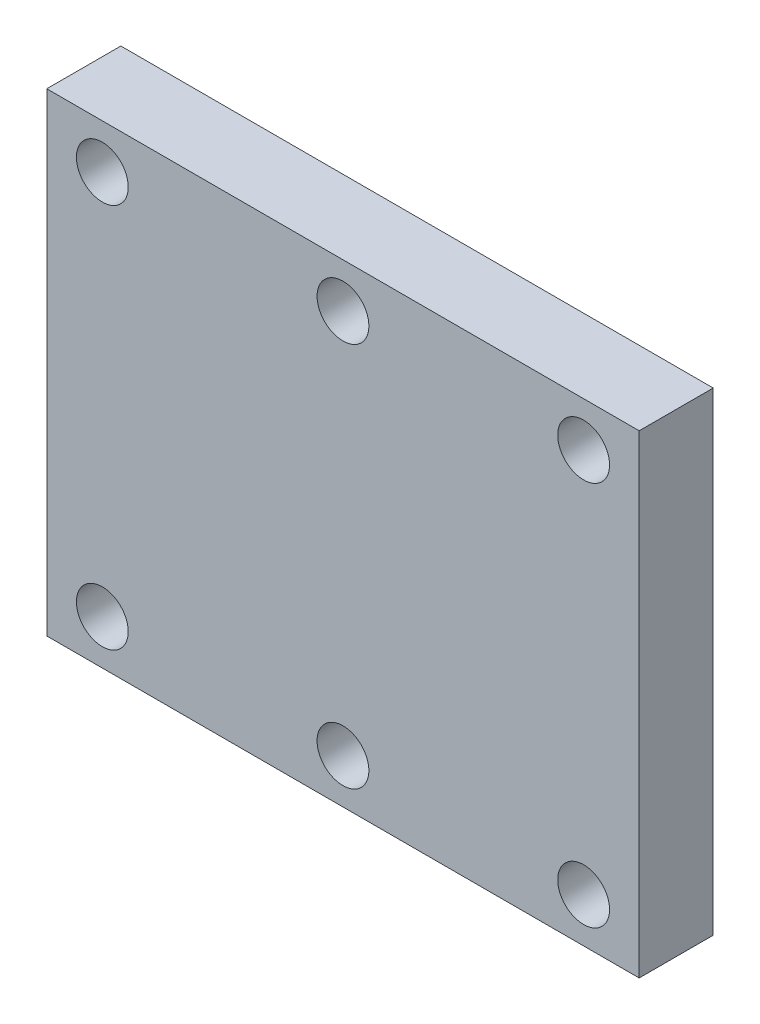
ISO-10303-21;
HEADER;
FILE_DESCRIPTION(('STEP AP214'),'2;1');
FILE_NAME('part.step','',(''),(''),'','','');
FILE_SCHEMA(('AUTOMOTIVE_DESIGN { 1 0 10303 214 1 1 1 1 }'));
ENDSEC;
DATA;
#1=APPLICATION_CONTEXT('core data for automotive mechanical design processes');
#2=APPLICATION_PROTOCOL_DEFINITION('international standard','automotive_design',2000,#1);
#3=PRODUCT_CONTEXT('',#1,'mechanical');
#4=PRODUCT('Part','Part','',(#3));
#5=PRODUCT_RELATED_PRODUCT_CATEGORY('part','',(#4));
#6=PRODUCT_DEFINITION_FORMATION('','',#4);
#7=PRODUCT_DEFINITION_CONTEXT('part definition',#1,'design');
#8=PRODUCT_DEFINITION('design','',#6,#7);
#9=PRODUCT_DEFINITION_SHAPE('','',#8);
#10=(LENGTH_UNIT() NAMED_UNIT(*) SI_UNIT(.MILLI.,.METRE.));
#11=(NAMED_UNIT(*) PLANE_ANGLE_UNIT() SI_UNIT($,.RADIAN.));
#12=(NAMED_UNIT(*) SI_UNIT($,.STERADIAN.) SOLID_ANGLE_UNIT());
#13=UNCERTAINTY_MEASURE_WITH_UNIT(LENGTH_MEASURE(1.E-05),#10,'distance_accuracy_value','');
#14=(GEOMETRIC_REPRESENTATION_CONTEXT(3) GLOBAL_UNCERTAINTY_ASSIGNED_CONTEXT((#13)) GLOBAL_UNIT_ASSIGNED_CONTEXT((#10,
#11,#12)) REPRESENTATION_CONTEXT('',''));
#15=CARTESIAN_POINT('',(0.,0.,0.));
#16=DIRECTION('',(0.,0.,1.));
#17=DIRECTION('',(1.,0.,0.));
#18=AXIS2_PLACEMENT_3D('',#15,#16,#17);
#19=CARTESIAN_POINT('',(72.5,26.,10.));
#20=DIRECTION('',(0.,0.,1.));
#21=DIRECTION('',(1.,0.,0.));
#22=AXIS2_PLACEMENT_3D('',#19,#20,#21);
#23=CYLINDRICAL_SURFACE('',#22,3.5);
#24=CARTESIAN_POINT('',(72.5,26.,10.));
#25=DIRECTION('',(0.,0.,1.));
#26=DIRECTION('',(1.,0.,0.));
#27=AXIS2_PLACEMENT_3D('',#24,#25,#26);
#28=CIRCLE('',#27,3.5);
#29=CARTESIAN_POINT('',(76.,26.,10.));
#30=VERTEX_POINT('',#29);
#31=EDGE_CURVE('E40',#30,#30,#28,.T.);
#32=ORIENTED_EDGE('',*,*,#31,.T.);
#33=EDGE_LOOP('',(#32));
#34=FACE_BOUND('',#33,.T.);
#35=CARTESIAN_POINT('',(72.5,26.,0.));
#36=DIRECTION('',(0.,0.,1.));
#37=DIRECTION('',(1.,0.,0.));
#38=AXIS2_PLACEMENT_3D('',#35,#36,#37);
#39=CIRCLE('',#38,3.5);
#40=CARTESIAN_POINT('',(76.,26.,0.));
#41=VERTEX_POINT('',#40);
#42=EDGE_CURVE('E11',#41,#41,#39,.T.);
#43=ORIENTED_EDGE('',*,*,#42,.F.);
#44=EDGE_LOOP('',(#43));
#45=FACE_BOUND('',#44,.T.);
#46=ADVANCED_FACE('F32',(#34,#45),#23,.F.);
#47=CARTESIAN_POINT('',(40.,26.,10.));
#48=DIRECTION('',(0.,0.,1.));
#49=DIRECTION('',(1.,0.,0.));
#50=AXIS2_PLACEMENT_3D('',#47,#48,#49);
#51=CYLINDRICAL_SURFACE('',#50,3.5);
#52=CARTESIAN_POINT('',(40.,26.,10.));
#53=DIRECTION('',(0.,0.,1.));
#54=DIRECTION('',(1.,0.,0.));
#55=AXIS2_PLACEMENT_3D('',#52,#53,#54);
#56=CIRCLE('',#55,3.5);
#57=CARTESIAN_POINT('',(43.5,26.,10.));
#58=VERTEX_POINT('',#57);
#59=EDGE_CURVE('E122',#58,#58,#56,.T.);
#60=ORIENTED_EDGE('',*,*,#59,.T.);
#61=EDGE_LOOP('',(#60));
#62=FACE_BOUND('',#61,.T.);
#63=CARTESIAN_POINT('',(40.,26.,0.));
#64=DIRECTION('',(0.,0.,1.));
#65=DIRECTION('',(1.,0.,0.));
#66=AXIS2_PLACEMENT_3D('',#63,#64,#65);
#67=CIRCLE('',#66,3.5);
#68=CARTESIAN_POINT('',(43.5,26.,0.));
#69=VERTEX_POINT('',#68);
#70=EDGE_CURVE('E125',#69,#69,#67,.T.);
#71=ORIENTED_EDGE('',*,*,#70,.F.);
#72=EDGE_LOOP('',(#71));
#73=FACE_BOUND('',#72,.T.);
#74=ADVANCED_FACE('F149',(#62,#73),#51,.F.);
#75=CARTESIAN_POINT('',(7.50000000000001,26.,10.));
#76=DIRECTION('',(0.,0.,1.));
#77=DIRECTION('',(1.,0.,0.));
#78=AXIS2_PLACEMENT_3D('',#75,#76,#77);
#79=CYLINDRICAL_SURFACE('',#78,3.5);
#80=CARTESIAN_POINT('',(7.50000000000001,26.,10.));
#81=DIRECTION('',(0.,0.,1.));
#82=DIRECTION('',(1.,0.,0.));
#83=AXIS2_PLACEMENT_3D('',#80,#81,#82);
#84=CIRCLE('',#83,3.5);
#85=CARTESIAN_POINT('',(11.,26.,10.));
#86=VERTEX_POINT('',#85);
#87=EDGE_CURVE('E116',#86,#86,#84,.T.);
#88=ORIENTED_EDGE('',*,*,#87,.T.);
#89=EDGE_LOOP('',(#88));
#90=FACE_BOUND('',#89,.T.);
#91=CARTESIAN_POINT('',(7.50000000000001,26.,0.));
#92=DIRECTION('',(0.,0.,1.));
#93=DIRECTION('',(1.,0.,0.));
#94=AXIS2_PLACEMENT_3D('',#91,#92,#93);
#95=CIRCLE('',#94,3.5);
#96=CARTESIAN_POINT('',(11.,26.,0.));
#97=VERTEX_POINT('',#96);
#98=EDGE_CURVE('E119',#97,#97,#95,.T.);
#99=ORIENTED_EDGE('',*,*,#98,.F.);
#100=EDGE_LOOP('',(#99));
#101=FACE_BOUND('',#100,.T.);
#102=ADVANCED_FACE('F153',(#90,#101),#79,.F.);
#103=CARTESIAN_POINT('',(72.5,-26.,10.));
#104=DIRECTION('',(0.,0.,1.));
#105=DIRECTION('',(1.,0.,0.));
#106=AXIS2_PLACEMENT_3D('',#103,#104,#105);
#107=CYLINDRICAL_SURFACE('',#106,3.5);
#108=CARTESIAN_POINT('',(72.5,-26.,10.));
#109=DIRECTION('',(0.,0.,1.));
#110=DIRECTION('',(1.,0.,0.));
#111=AXIS2_PLACEMENT_3D('',#108,#109,#110);
#112=CIRCLE('',#111,3.5);
#113=CARTESIAN_POINT('',(76.,-26.,10.));
#114=VERTEX_POINT('',#113);
#115=EDGE_CURVE('E110',#114,#114,#112,.T.);
#116=ORIENTED_EDGE('',*,*,#115,.T.);
#117=EDGE_LOOP('',(#116));
#118=FACE_BOUND('',#117,.T.);
#119=CARTESIAN_POINT('',(72.5,-26.,0.));
#120=DIRECTION('',(0.,0.,1.));
#121=DIRECTION('',(1.,0.,0.));
#122=AXIS2_PLACEMENT_3D('',#119,#120,#121);
#123=CIRCLE('',#122,3.5);
#124=CARTESIAN_POINT('',(76.,-26.,0.));
#125=VERTEX_POINT('',#124);
#126=EDGE_CURVE('E113',#125,#125,#123,.T.);
#127=ORIENTED_EDGE('',*,*,#126,.F.);
#128=EDGE_LOOP('',(#127));
#129=FACE_BOUND('',#128,.T.);
#130=ADVANCED_FACE('F158',(#118,#129),#107,.F.);
#131=CARTESIAN_POINT('',(0.,32.,10.));
#132=DIRECTION('',(1.,0.,0.));
#133=DIRECTION('',(0.,0.,-1.));
#134=AXIS2_PLACEMENT_3D('',#131,#132,#133);
#135=PLANE('',#134);
#136=DIRECTION('',(0.,-1.,0.));
#137=VECTOR('',#136,1.);
#138=CARTESIAN_POINT('',(0.,32.,0.));
#139=LINE('',#138,#137);
#140=CARTESIAN_POINT('',(0.,32.,0.));
#141=VERTEX_POINT('',#140);
#142=CARTESIAN_POINT('',(0.,-32.,0.));
#143=VERTEX_POINT('',#142);
#144=EDGE_CURVE('E100',#141,#143,#139,.T.);
#145=ORIENTED_EDGE('',*,*,#144,.T.);
#146=DIRECTION('',(0.,0.,-1.));
#147=VECTOR('',#146,1.);
#148=CARTESIAN_POINT('',(0.,-32.,10.));
#149=LINE('',#148,#147);
#150=CARTESIAN_POINT('',(0.,-32.,10.));
#151=VERTEX_POINT('',#150);
#152=EDGE_CURVE('E91',#151,#143,#149,.T.);
#153=ORIENTED_EDGE('',*,*,#152,.F.);
#154=DIRECTION('',(0.,-1.,0.));
#155=VECTOR('',#154,1.);
#156=CARTESIAN_POINT('',(0.,32.,10.));
#157=LINE('',#156,#155);
#158=CARTESIAN_POINT('',(0.,32.,10.));
#159=VERTEX_POINT('',#158);
#160=EDGE_CURVE('E85',#159,#151,#157,.T.);
#161=ORIENTED_EDGE('',*,*,#160,.F.);
#162=DIRECTION('',(0.,0.,-1.));
#163=VECTOR('',#162,1.);
#164=CARTESIAN_POINT('',(0.,32.,10.));
#165=LINE('',#164,#163);
#166=EDGE_CURVE('E96',#159,#141,#165,.T.);
#167=ORIENTED_EDGE('',*,*,#166,.T.);
#168=EDGE_LOOP('',(#145,#153,#161,#167));
#169=FACE_BOUND('',#168,.T.);
#170=ADVANCED_FACE('F165',(#169),#135,.F.);
#171=CARTESIAN_POINT('',(0.,-32.,10.));
#172=DIRECTION('',(0.,1.,0.));
#173=DIRECTION('',(0.,0.,1.));
#174=AXIS2_PLACEMENT_3D('',#171,#172,#173);
#175=PLANE('',#174);
#176=DIRECTION('',(1.,0.,0.));
#177=VECTOR('',#176,1.);
#178=CARTESIAN_POINT('',(0.,-32.,0.));
#179=LINE('',#178,#177);
#180=CARTESIAN_POINT('',(80.,-32.,0.));
#181=VERTEX_POINT('',#180);
#182=EDGE_CURVE('E90',#143,#181,#179,.T.);
#183=ORIENTED_EDGE('',*,*,#182,.T.);
#184=DIRECTION('',(0.,0.,-1.));
#185=VECTOR('',#184,1.);
#186=CARTESIAN_POINT('',(80.,-32.,10.));
#187=LINE('',#186,#185);
#188=CARTESIAN_POINT('',(80.,-32.,10.));
#189=VERTEX_POINT('',#188);
#190=EDGE_CURVE('E88',#189,#181,#187,.T.);
#191=ORIENTED_EDGE('',*,*,#190,.F.);
#192=DIRECTION('',(1.,0.,0.));
#193=VECTOR('',#192,1.);
#194=CARTESIAN_POINT('',(0.,-32.,10.));
#195=LINE('',#194,#193);
#196=EDGE_CURVE('E79',#151,#189,#195,.T.);
#197=ORIENTED_EDGE('',*,*,#196,.F.);
#198=ORIENTED_EDGE('',*,*,#152,.T.);
#199=EDGE_LOOP('',(#183,#191,#197,#198));
#200=FACE_BOUND('',#199,.T.);
#201=ADVANCED_FACE('F89',(#200),#175,.F.);
#202=CARTESIAN_POINT('',(80.,32.,10.));
#203=DIRECTION('',(-1.,0.,0.));
#204=DIRECTION('',(0.,0.,1.));
#205=AXIS2_PLACEMENT_3D('',#202,#203,#204);
#206=PLANE('',#205);
#207=DIRECTION('',(0.,1.,0.));
#208=VECTOR('',#207,1.);
#209=CARTESIAN_POINT('',(80.,32.,0.));
#210=LINE('',#209,#208);
#211=CARTESIAN_POINT('',(80.,32.,0.));
#212=VERTEX_POINT('',#211);
#213=EDGE_CURVE('E65',#181,#212,#210,.T.);
#214=ORIENTED_EDGE('',*,*,#213,.T.);
#215=DIRECTION('',(0.,0.,-1.));
#216=VECTOR('',#215,1.);
#217=CARTESIAN_POINT('',(80.,32.,10.));
#218=LINE('',#217,#216);
#219=CARTESIAN_POINT('',(80.,32.,10.));
#220=VERTEX_POINT('',#219);
#221=EDGE_CURVE('E92',#220,#212,#218,.T.);
#222=ORIENTED_EDGE('',*,*,#221,.F.);
#223=DIRECTION('',(0.,1.,0.));
#224=VECTOR('',#223,1.);
#225=CARTESIAN_POINT('',(80.,32.,10.));
#226=LINE('',#225,#224);
#227=EDGE_CURVE('E83',#189,#220,#226,.T.);
#228=ORIENTED_EDGE('',*,*,#227,.F.);
#229=ORIENTED_EDGE('',*,*,#190,.T.);
#230=EDGE_LOOP('',(#214,#222,#228,#229));
#231=FACE_BOUND('',#230,.T.);
#232=ADVANCED_FACE('F94',(#231),#206,.F.);
#233=CARTESIAN_POINT('',(0.,32.,10.));
#234=DIRECTION('',(0.,-1.,0.));
#235=DIRECTION('',(0.,0.,-1.));
#236=AXIS2_PLACEMENT_3D('',#233,#234,#235);
#237=PLANE('',#236);
#238=DIRECTION('',(-1.,0.,0.));
#239=VECTOR('',#238,1.);
#240=CARTESIAN_POINT('',(0.,32.,0.));
#241=LINE('',#240,#239);
#242=EDGE_CURVE('E71',#212,#141,#241,.T.);
#243=ORIENTED_EDGE('',*,*,#242,.T.);
#244=ORIENTED_EDGE('',*,*,#166,.F.);
#245=DIRECTION('',(-1.,0.,0.));
#246=VECTOR('',#245,1.);
#247=CARTESIAN_POINT('',(0.,32.,10.));
#248=LINE('',#247,#246);
#249=EDGE_CURVE('E48',#220,#159,#248,.T.);
#250=ORIENTED_EDGE('',*,*,#249,.F.);
#251=ORIENTED_EDGE('',*,*,#221,.T.);
#252=EDGE_LOOP('',(#243,#244,#250,#251));
#253=FACE_BOUND('',#252,.T.);
#254=ADVANCED_FACE('F134',(#253),#237,.F.);
#255=CARTESIAN_POINT('',(0.,0.,10.));
#256=DIRECTION('',(0.,0.,1.));
#257=DIRECTION('',(1.,0.,0.));
#258=AXIS2_PLACEMENT_3D('',#255,#256,#257);
#259=PLANE('',#258);
#260=CARTESIAN_POINT('',(40.,-26.,10.));
#261=DIRECTION('',(0.,0.,1.));
#262=DIRECTION('',(1.,0.,0.));
#263=AXIS2_PLACEMENT_3D('',#260,#261,#262);
#264=CIRCLE('',#263,3.5);
#265=CARTESIAN_POINT('',(43.5,-26.,10.));
#266=VERTEX_POINT('',#265);
#267=EDGE_CURVE('E235',#266,#266,#264,.T.);
#268=ORIENTED_EDGE('',*,*,#267,.F.);
#269=EDGE_LOOP('',(#268));
#270=FACE_BOUND('',#269,.T.);
#271=CARTESIAN_POINT('',(7.50000000000001,-26.,10.));
#272=DIRECTION('',(0.,0.,1.));
#273=DIRECTION('',(1.,0.,0.));
#274=AXIS2_PLACEMENT_3D('',#271,#272,#273);
#275=CIRCLE('',#274,3.5);
#276=CARTESIAN_POINT('',(11.,-26.,10.));
#277=VERTEX_POINT('',#276);
#278=EDGE_CURVE('E239',#277,#277,#275,.T.);
#279=ORIENTED_EDGE('',*,*,#278,.F.);
#280=EDGE_LOOP('',(#279));
#281=FACE_BOUND('',#280,.T.);
#282=ORIENTED_EDGE('',*,*,#160,.T.);
#283=ORIENTED_EDGE('',*,*,#196,.T.);
#284=ORIENTED_EDGE('',*,*,#227,.T.);
#285=ORIENTED_EDGE('',*,*,#249,.T.);
#286=EDGE_LOOP('',(#282,#283,#284,#285));
#287=FACE_BOUND('',#286,.T.);
#288=ORIENTED_EDGE('',*,*,#115,.F.);
#289=EDGE_LOOP('',(#288));
#290=FACE_BOUND('',#289,.T.);
#291=ORIENTED_EDGE('',*,*,#87,.F.);
#292=EDGE_LOOP('',(#291));
#293=FACE_BOUND('',#292,.T.);
#294=ORIENTED_EDGE('',*,*,#59,.F.);
#295=EDGE_LOOP('',(#294));
#296=FACE_BOUND('',#295,.T.);
#297=ORIENTED_EDGE('',*,*,#31,.F.);
#298=EDGE_LOOP('',(#297));
#299=FACE_BOUND('',#298,.T.);
#300=ADVANCED_FACE('F80',(#270,#281,#287,#290,#293,#296,#299),#259,.T.);
#301=CARTESIAN_POINT('',(0.,0.,0.));
#302=DIRECTION('',(0.,0.,1.));
#303=DIRECTION('',(1.,0.,0.));
#304=AXIS2_PLACEMENT_3D('',#301,#302,#303);
#305=PLANE('',#304);
#306=CARTESIAN_POINT('',(40.,-26.,0.));
#307=DIRECTION('',(0.,0.,1.));
#308=DIRECTION('',(1.,0.,0.));
#309=AXIS2_PLACEMENT_3D('',#306,#307,#308);
#310=CIRCLE('',#309,3.5);
#311=CARTESIAN_POINT('',(43.5,-26.,0.));
#312=VERTEX_POINT('',#311);
#313=EDGE_CURVE('E238',#312,#312,#310,.T.);
#314=ORIENTED_EDGE('',*,*,#313,.T.);
#315=EDGE_LOOP('',(#314));
#316=FACE_BOUND('',#315,.T.);
#317=CARTESIAN_POINT('',(7.50000000000001,-26.,0.));
#318=DIRECTION('',(0.,0.,1.));
#319=DIRECTION('',(1.,0.,0.));
#320=AXIS2_PLACEMENT_3D('',#317,#318,#319);
#321=CIRCLE('',#320,3.5);
#322=CARTESIAN_POINT('',(11.,-26.,0.));
#323=VERTEX_POINT('',#322);
#324=EDGE_CURVE('E103',#323,#323,#321,.T.);
#325=ORIENTED_EDGE('',*,*,#324,.T.);
#326=EDGE_LOOP('',(#325));
#327=FACE_BOUND('',#326,.T.);
#328=ORIENTED_EDGE('',*,*,#144,.F.);
#329=ORIENTED_EDGE('',*,*,#242,.F.);
#330=ORIENTED_EDGE('',*,*,#213,.F.);
#331=ORIENTED_EDGE('',*,*,#182,.F.);
#332=EDGE_LOOP('',(#328,#329,#330,#331));
#333=FACE_BOUND('',#332,.T.);
#334=ORIENTED_EDGE('',*,*,#126,.T.);
#335=EDGE_LOOP('',(#334));
#336=FACE_BOUND('',#335,.T.);
#337=ORIENTED_EDGE('',*,*,#98,.T.);
#338=EDGE_LOOP('',(#337));
#339=FACE_BOUND('',#338,.T.);
#340=ORIENTED_EDGE('',*,*,#70,.T.);
#341=EDGE_LOOP('',(#340));
#342=FACE_BOUND('',#341,.T.);
#343=ORIENTED_EDGE('',*,*,#42,.T.);
#344=EDGE_LOOP('',(#343));
#345=FACE_BOUND('',#344,.T.);
#346=ADVANCED_FACE('F133',(#316,#327,#333,#336,#339,#342,#345),#305,.F.);
#347=CARTESIAN_POINT('',(7.50000000000001,-26.,10.));
#348=DIRECTION('',(0.,0.,1.));
#349=DIRECTION('',(1.,0.,0.));
#350=AXIS2_PLACEMENT_3D('',#347,#348,#349);
#351=CYLINDRICAL_SURFACE('',#350,3.5);
#352=ORIENTED_EDGE('',*,*,#278,.T.);
#353=EDGE_LOOP('',(#352));
#354=FACE_BOUND('',#353,.T.);
#355=ORIENTED_EDGE('',*,*,#324,.F.);
#356=EDGE_LOOP('',(#355));
#357=FACE_BOUND('',#356,.T.);
#358=ADVANCED_FACE('F141',(#354,#357),#351,.F.);
#359=CARTESIAN_POINT('',(40.,-26.,10.));
#360=DIRECTION('',(0.,0.,1.));
#361=DIRECTION('',(1.,0.,0.));
#362=AXIS2_PLACEMENT_3D('',#359,#360,#361);
#363=CYLINDRICAL_SURFACE('',#362,3.5);
#364=ORIENTED_EDGE('',*,*,#267,.T.);
#365=EDGE_LOOP('',(#364));
#366=FACE_BOUND('',#365,.T.);
#367=ORIENTED_EDGE('',*,*,#313,.F.);
#368=EDGE_LOOP('',(#367));
#369=FACE_BOUND('',#368,.T.);
#370=ADVANCED_FACE('F190',(#366,#369),#363,.F.);
#371=CLOSED_SHELL('',(#46,#74,#102,#130,#170,#201,#232,#254,#300,#346,#358,#370));
#372=MANIFOLD_SOLID_BREP('B2',#371);
#373=ADVANCED_BREP_SHAPE_REPRESENTATION('',(#18,#372),#14);
#374=SHAPE_DEFINITION_REPRESENTATION(#9,#373);
ENDSEC;
END-ISO-10303-21;
